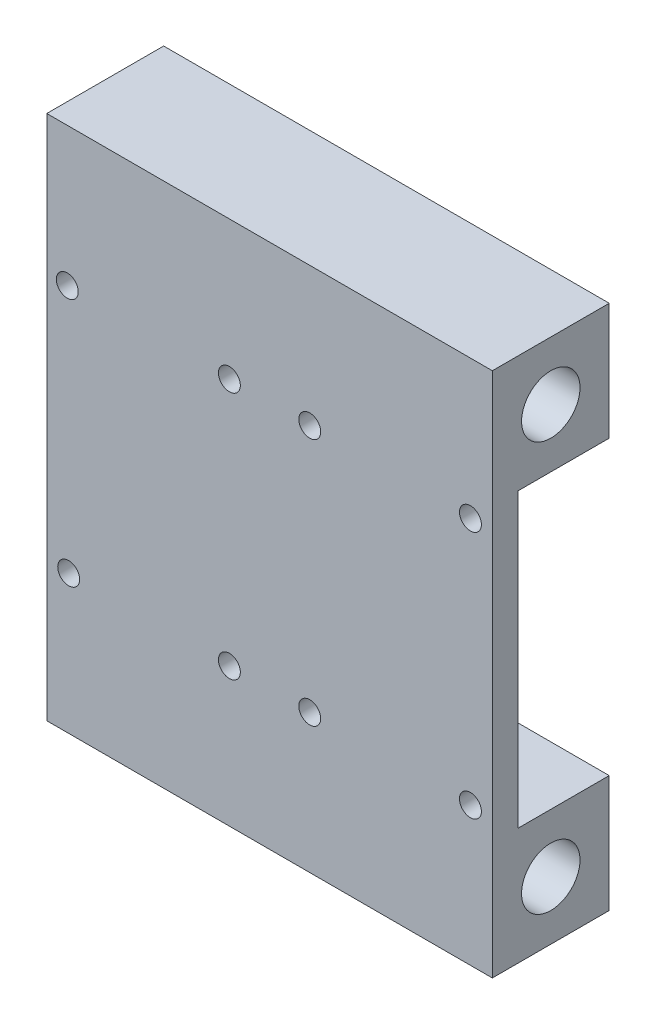
ISO-10303-21;
HEADER;
FILE_DESCRIPTION(('STEP AP214'),'2;1');
FILE_NAME('part.step','',(''),(''),'','','');
FILE_SCHEMA(('AUTOMOTIVE_DESIGN { 1 0 10303 214 1 1 1 1 }'));
ENDSEC;
DATA;
#1=APPLICATION_CONTEXT('core data for automotive mechanical design processes');
#2=APPLICATION_PROTOCOL_DEFINITION('international standard','automotive_design',2000,#1);
#3=PRODUCT_CONTEXT('',#1,'mechanical');
#4=PRODUCT('Part','Part','',(#3));
#5=PRODUCT_RELATED_PRODUCT_CATEGORY('part','',(#4));
#6=PRODUCT_DEFINITION_FORMATION('','',#4);
#7=PRODUCT_DEFINITION_CONTEXT('part definition',#1,'design');
#8=PRODUCT_DEFINITION('design','',#6,#7);
#9=PRODUCT_DEFINITION_SHAPE('','',#8);
#10=(LENGTH_UNIT() NAMED_UNIT(*) SI_UNIT(.MILLI.,.METRE.));
#11=(NAMED_UNIT(*) PLANE_ANGLE_UNIT() SI_UNIT($,.RADIAN.));
#12=(NAMED_UNIT(*) SI_UNIT($,.STERADIAN.) SOLID_ANGLE_UNIT());
#13=UNCERTAINTY_MEASURE_WITH_UNIT(LENGTH_MEASURE(1.E-05),#10,'distance_accuracy_value','');
#14=(GEOMETRIC_REPRESENTATION_CONTEXT(3) GLOBAL_UNCERTAINTY_ASSIGNED_CONTEXT((#13)) GLOBAL_UNIT_ASSIGNED_CONTEXT((#10,
#11,#12)) REPRESENTATION_CONTEXT('',''));
#15=CARTESIAN_POINT('',(0.,0.,0.));
#16=DIRECTION('',(0.,0.,1.));
#17=DIRECTION('',(1.,0.,0.));
#18=AXIS2_PLACEMENT_3D('',#15,#16,#17);
#19=CARTESIAN_POINT('',(-22.6274169979695,-8.,-4.5));
#20=DIRECTION('',(1.,0.,0.));
#21=DIRECTION('',(0.,0.,-1.));
#22=AXIS2_PLACEMENT_3D('',#19,#20,#21);
#23=CYLINDRICAL_SURFACE('',#22,4.);
#24=CARTESIAN_POINT('',(88.,-8.,-4.5));
#25=DIRECTION('',(-1.,0.,0.));
#26=DIRECTION('',(0.,0.,1.));
#27=AXIS2_PLACEMENT_3D('',#24,#25,#26);
#28=CIRCLE('',#27,4.);
#29=CARTESIAN_POINT('',(88.,-8.,-0.500000000000001));
#30=VERTEX_POINT('',#29);
#31=EDGE_CURVE('E39',#30,#30,#28,.F.);
#32=ORIENTED_EDGE('',*,*,#31,.T.);
#33=EDGE_LOOP('',(#32));
#34=FACE_BOUND('',#33,.T.);
#35=CARTESIAN_POINT('',(27.,-8.,-4.5));
#36=DIRECTION('',(1.,0.,0.));
#37=DIRECTION('',(0.,0.,-1.));
#38=AXIS2_PLACEMENT_3D('',#35,#36,#37);
#39=CIRCLE('',#38,4.);
#40=CARTESIAN_POINT('',(27.,-8.,-8.5));
#41=VERTEX_POINT('',#40);
#42=EDGE_CURVE('E141',#41,#41,#39,.F.);
#43=ORIENTED_EDGE('',*,*,#42,.T.);
#44=EDGE_LOOP('',(#43));
#45=FACE_BOUND('',#44,.T.);
#46=ADVANCED_FACE('F35',(#34,#45),#23,.F.);
#47=CARTESIAN_POINT('',(27.,37.0557833558908,80.3960337078578));
#48=DIRECTION('',(1.,0.,0.));
#49=DIRECTION('',(0.,0.,-1.));
#50=AXIS2_PLACEMENT_3D('',#47,#48,#49);
#51=PLANE('',#50);
#52=ORIENTED_EDGE('',*,*,#42,.F.);
#53=EDGE_LOOP('',(#52));
#54=FACE_BOUND('',#53,.T.);
#55=DIRECTION('',(0.,0.,1.));
#56=VECTOR('',#55,1.);
#57=CARTESIAN_POINT('',(27.,40.,3.5));
#58=LINE('',#57,#56);
#59=CARTESIAN_POINT('',(27.,40.,-12.5));
#60=VERTEX_POINT('',#59);
#61=CARTESIAN_POINT('',(27.,40.,0.));
#62=VERTEX_POINT('',#61);
#63=EDGE_CURVE('E160',#60,#62,#58,.T.);
#64=ORIENTED_EDGE('',*,*,#63,.T.);
#65=DIRECTION('',(0.,-1.,0.));
#66=VECTOR('',#65,1.);
#67=CARTESIAN_POINT('',(27.,0.,0.));
#68=LINE('',#67,#66);
#69=CARTESIAN_POINT('',(27.,0.,0.));
#70=VERTEX_POINT('',#69);
#71=EDGE_CURVE('E60',#62,#70,#68,.T.);
#72=ORIENTED_EDGE('',*,*,#71,.T.);
#73=DIRECTION('',(0.,0.,-1.));
#74=VECTOR('',#73,1.);
#75=CARTESIAN_POINT('',(27.,0.,3.5));
#76=LINE('',#75,#74);
#77=CARTESIAN_POINT('',(27.,0.,-12.5));
#78=VERTEX_POINT('',#77);
#79=EDGE_CURVE('E143',#70,#78,#76,.T.);
#80=ORIENTED_EDGE('',*,*,#79,.T.);
#81=DIRECTION('',(0.,-1.,0.));
#82=VECTOR('',#81,1.);
#83=CARTESIAN_POINT('',(27.,37.0557833558908,-12.5));
#84=LINE('',#83,#82);
#85=CARTESIAN_POINT('',(27.,-16.,-12.5));
#86=VERTEX_POINT('',#85);
#87=EDGE_CURVE('E156',#78,#86,#84,.T.);
#88=ORIENTED_EDGE('',*,*,#87,.T.);
#89=DIRECTION('',(0.,0.,-1.));
#90=VECTOR('',#89,1.);
#91=CARTESIAN_POINT('',(27.,-16.,80.3960337078578));
#92=LINE('',#91,#90);
#93=CARTESIAN_POINT('',(27.,-16.,3.5));
#94=VERTEX_POINT('',#93);
#95=EDGE_CURVE('E123',#94,#86,#92,.T.);
#96=ORIENTED_EDGE('',*,*,#95,.F.);
#97=DIRECTION('',(0.,1.,0.));
#98=VECTOR('',#97,1.);
#99=CARTESIAN_POINT('',(27.,37.0557833558908,3.5));
#100=LINE('',#99,#98);
#101=CARTESIAN_POINT('',(27.,56.,3.5));
#102=VERTEX_POINT('',#101);
#103=EDGE_CURVE('E151',#94,#102,#100,.T.);
#104=ORIENTED_EDGE('',*,*,#103,.T.);
#105=DIRECTION('',(0.,0.,-1.));
#106=VECTOR('',#105,1.);
#107=CARTESIAN_POINT('',(27.,56.,80.3960337078578));
#108=LINE('',#107,#106);
#109=CARTESIAN_POINT('',(27.,56.,-12.5));
#110=VERTEX_POINT('',#109);
#111=EDGE_CURVE('E153',#102,#110,#108,.T.);
#112=ORIENTED_EDGE('',*,*,#111,.T.);
#113=EDGE_CURVE('E154',#110,#60,#84,.T.);
#114=ORIENTED_EDGE('',*,*,#113,.T.);
#115=EDGE_LOOP('',(#64,#72,#80,#88,#96,#104,#112,#114));
#116=FACE_BOUND('',#115,.T.);
#117=CARTESIAN_POINT('',(27.,48.,-4.5));
#118=DIRECTION('',(1.,0.,0.));
#119=DIRECTION('',(0.,0.,-1.));
#120=AXIS2_PLACEMENT_3D('',#117,#118,#119);
#121=CIRCLE('',#120,4.);
#122=CARTESIAN_POINT('',(27.,48.,-8.5));
#123=VERTEX_POINT('',#122);
#124=EDGE_CURVE('E162',#123,#123,#121,.F.);
#125=ORIENTED_EDGE('',*,*,#124,.F.);
#126=EDGE_LOOP('',(#125));
#127=FACE_BOUND('',#126,.T.);
#128=ADVANCED_FACE('F240',(#54,#116,#127),#51,.F.);
#129=CARTESIAN_POINT('',(88.,56.,80.3960337078578));
#130=DIRECTION('',(-1.,0.,0.));
#131=DIRECTION('',(0.,0.,1.));
#132=AXIS2_PLACEMENT_3D('',#129,#130,#131);
#133=PLANE('',#132);
#134=ORIENTED_EDGE('',*,*,#31,.F.);
#135=EDGE_LOOP('',(#134));
#136=FACE_BOUND('',#135,.T.);
#137=DIRECTION('',(0.,0.,-1.));
#138=VECTOR('',#137,1.);
#139=CARTESIAN_POINT('',(88.,40.,3.5));
#140=LINE('',#139,#138);
#141=CARTESIAN_POINT('',(88.,40.,0.));
#142=VERTEX_POINT('',#141);
#143=CARTESIAN_POINT('',(88.,40.,-12.5));
#144=VERTEX_POINT('',#143);
#145=EDGE_CURVE('E169',#142,#144,#140,.T.);
#146=ORIENTED_EDGE('',*,*,#145,.T.);
#147=DIRECTION('',(0.,1.,0.));
#148=VECTOR('',#147,1.);
#149=CARTESIAN_POINT('',(88.,56.,-12.5));
#150=LINE('',#149,#148);
#151=CARTESIAN_POINT('',(88.,56.,-12.5));
#152=VERTEX_POINT('',#151);
#153=EDGE_CURVE('E119',#144,#152,#150,.T.);
#154=ORIENTED_EDGE('',*,*,#153,.T.);
#155=DIRECTION('',(0.,0.,-1.));
#156=VECTOR('',#155,1.);
#157=CARTESIAN_POINT('',(88.,56.,80.3960337078578));
#158=LINE('',#157,#156);
#159=CARTESIAN_POINT('',(88.,56.,3.5));
#160=VERTEX_POINT('',#159);
#161=EDGE_CURVE('E109',#160,#152,#158,.T.);
#162=ORIENTED_EDGE('',*,*,#161,.F.);
#163=DIRECTION('',(0.,-1.,0.));
#164=VECTOR('',#163,1.);
#165=CARTESIAN_POINT('',(88.,56.,3.5));
#166=LINE('',#165,#164);
#167=CARTESIAN_POINT('',(88.,-16.,3.5));
#168=VERTEX_POINT('',#167);
#169=EDGE_CURVE('E104',#160,#168,#166,.T.);
#170=ORIENTED_EDGE('',*,*,#169,.T.);
#171=DIRECTION('',(0.,0.,-1.));
#172=VECTOR('',#171,1.);
#173=CARTESIAN_POINT('',(88.,-16.,80.3960337078578));
#174=LINE('',#173,#172);
#175=CARTESIAN_POINT('',(88.,-16.,-12.5));
#176=VERTEX_POINT('',#175);
#177=EDGE_CURVE('E100',#168,#176,#174,.T.);
#178=ORIENTED_EDGE('',*,*,#177,.T.);
#179=CARTESIAN_POINT('',(88.,0.,-12.5));
#180=VERTEX_POINT('',#179);
#181=EDGE_CURVE('E52',#176,#180,#150,.T.);
#182=ORIENTED_EDGE('',*,*,#181,.T.);
#183=DIRECTION('',(0.,0.,1.));
#184=VECTOR('',#183,1.);
#185=CARTESIAN_POINT('',(88.,0.,3.5));
#186=LINE('',#185,#184);
#187=CARTESIAN_POINT('',(88.,0.,0.));
#188=VERTEX_POINT('',#187);
#189=EDGE_CURVE('E165',#180,#188,#186,.T.);
#190=ORIENTED_EDGE('',*,*,#189,.T.);
#191=DIRECTION('',(0.,1.,0.));
#192=VECTOR('',#191,1.);
#193=CARTESIAN_POINT('',(88.,0.,0.));
#194=LINE('',#193,#192);
#195=EDGE_CURVE('E167',#188,#142,#194,.T.);
#196=ORIENTED_EDGE('',*,*,#195,.T.);
#197=EDGE_LOOP('',(#146,#154,#162,#170,#178,#182,#190,#196));
#198=FACE_BOUND('',#197,.T.);
#199=CARTESIAN_POINT('',(88.,48.,-4.5));
#200=DIRECTION('',(-1.,0.,0.));
#201=DIRECTION('',(0.,0.,1.));
#202=AXIS2_PLACEMENT_3D('',#199,#200,#201);
#203=CIRCLE('',#202,4.);
#204=CARTESIAN_POINT('',(88.,48.,-0.499999999999994));
#205=VERTEX_POINT('',#204);
#206=EDGE_CURVE('E171',#205,#205,#203,.F.);
#207=ORIENTED_EDGE('',*,*,#206,.F.);
#208=EDGE_LOOP('',(#207));
#209=FACE_BOUND('',#208,.T.);
#210=ADVANCED_FACE('F101',(#136,#198,#209),#133,.F.);
#211=CARTESIAN_POINT('',(85.,3.,7.74264068711929));
#212=DIRECTION('',(0.,0.,-1.));
#213=DIRECTION('',(-1.,0.,0.));
#214=AXIS2_PLACEMENT_3D('',#211,#212,#213);
#215=CYLINDRICAL_SURFACE('',#214,1.5);
#216=CARTESIAN_POINT('',(85.,3.,3.5));
#217=DIRECTION('',(0.,0.,-1.));
#218=DIRECTION('',(-1.,0.,0.));
#219=AXIS2_PLACEMENT_3D('',#216,#217,#218);
#220=CIRCLE('',#219,1.5);
#221=CARTESIAN_POINT('',(83.5,3.,3.5));
#222=VERTEX_POINT('',#221);
#223=EDGE_CURVE('E186',#222,#222,#220,.F.);
#224=ORIENTED_EDGE('',*,*,#223,.T.);
#225=EDGE_LOOP('',(#224));
#226=FACE_BOUND('',#225,.T.);
#227=CARTESIAN_POINT('',(85.,3.,0.));
#228=DIRECTION('',(0.,0.,-1.));
#229=DIRECTION('',(-1.,0.,0.));
#230=AXIS2_PLACEMENT_3D('',#227,#228,#229);
#231=CIRCLE('',#230,1.5);
#232=CARTESIAN_POINT('',(83.5,3.,0.));
#233=VERTEX_POINT('',#232);
#234=EDGE_CURVE('E174',#233,#233,#231,.T.);
#235=ORIENTED_EDGE('',*,*,#234,.T.);
#236=EDGE_LOOP('',(#235));
#237=FACE_BOUND('',#236,.T.);
#238=ADVANCED_FACE('F298',(#226,#237),#215,.F.);
#239=CARTESIAN_POINT('',(30.,3.,7.74264068711929));
#240=DIRECTION('',(0.,0.,-1.));
#241=DIRECTION('',(-1.,0.,0.));
#242=AXIS2_PLACEMENT_3D('',#239,#240,#241);
#243=CYLINDRICAL_SURFACE('',#242,1.5);
#244=CARTESIAN_POINT('',(30.,3.,3.5));
#245=DIRECTION('',(0.,0.,-1.));
#246=DIRECTION('',(-1.,0.,0.));
#247=AXIS2_PLACEMENT_3D('',#244,#245,#246);
#248=CIRCLE('',#247,1.5);
#249=CARTESIAN_POINT('',(28.5,3.,3.5));
#250=VERTEX_POINT('',#249);
#251=EDGE_CURVE('E179',#250,#250,#248,.F.);
#252=ORIENTED_EDGE('',*,*,#251,.T.);
#253=EDGE_LOOP('',(#252));
#254=FACE_BOUND('',#253,.T.);
#255=CARTESIAN_POINT('',(30.,3.,0.));
#256=DIRECTION('',(0.,0.,-1.));
#257=DIRECTION('',(-1.,0.,0.));
#258=AXIS2_PLACEMENT_3D('',#255,#256,#257);
#259=CIRCLE('',#258,1.5);
#260=CARTESIAN_POINT('',(28.5,3.,0.));
#261=VERTEX_POINT('',#260);
#262=EDGE_CURVE('E183',#261,#261,#259,.T.);
#263=ORIENTED_EDGE('',*,*,#262,.T.);
#264=EDGE_LOOP('',(#263));
#265=FACE_BOUND('',#264,.T.);
#266=ADVANCED_FACE('F301',(#254,#265),#243,.F.);
#267=CARTESIAN_POINT('',(29.809705398951,37.,7.74264068711929));
#268=DIRECTION('',(0.,0.,-1.));
#269=DIRECTION('',(-1.,0.,0.));
#270=AXIS2_PLACEMENT_3D('',#267,#268,#269);
#271=CYLINDRICAL_SURFACE('',#270,1.5);
#272=CARTESIAN_POINT('',(29.809705398951,37.,3.5));
#273=DIRECTION('',(0.,0.,-1.));
#274=DIRECTION('',(-1.,0.,0.));
#275=AXIS2_PLACEMENT_3D('',#272,#273,#274);
#276=CIRCLE('',#275,1.5);
#277=CARTESIAN_POINT('',(28.309705398951,37.,3.5));
#278=VERTEX_POINT('',#277);
#279=EDGE_CURVE('E178',#278,#278,#276,.F.);
#280=ORIENTED_EDGE('',*,*,#279,.T.);
#281=EDGE_LOOP('',(#280));
#282=FACE_BOUND('',#281,.T.);
#283=CARTESIAN_POINT('',(29.809705398951,37.,0.));
#284=DIRECTION('',(0.,0.,-1.));
#285=DIRECTION('',(-1.,0.,0.));
#286=AXIS2_PLACEMENT_3D('',#283,#284,#285);
#287=CIRCLE('',#286,1.5);
#288=CARTESIAN_POINT('',(28.309705398951,37.,0.));
#289=VERTEX_POINT('',#288);
#290=EDGE_CURVE('E175',#289,#289,#287,.T.);
#291=ORIENTED_EDGE('',*,*,#290,.T.);
#292=EDGE_LOOP('',(#291));
#293=FACE_BOUND('',#292,.T.);
#294=ADVANCED_FACE('F285',(#282,#293),#271,.F.);
#295=CARTESIAN_POINT('',(63.,37.,7.74264068711929));
#296=DIRECTION('',(0.,0.,-1.));
#297=DIRECTION('',(-1.,0.,0.));
#298=AXIS2_PLACEMENT_3D('',#295,#296,#297);
#299=CYLINDRICAL_SURFACE('',#298,1.5);
#300=CARTESIAN_POINT('',(63.,37.,3.5));
#301=DIRECTION('',(0.,0.,-1.));
#302=DIRECTION('',(-1.,0.,0.));
#303=AXIS2_PLACEMENT_3D('',#300,#301,#302);
#304=CIRCLE('',#303,1.5);
#305=CARTESIAN_POINT('',(61.5,37.,3.5));
#306=VERTEX_POINT('',#305);
#307=EDGE_CURVE('E128',#306,#306,#304,.F.);
#308=ORIENTED_EDGE('',*,*,#307,.T.);
#309=EDGE_LOOP('',(#308));
#310=FACE_BOUND('',#309,.T.);
#311=CARTESIAN_POINT('',(63.,37.,0.));
#312=DIRECTION('',(0.,0.,-1.));
#313=DIRECTION('',(-1.,0.,0.));
#314=AXIS2_PLACEMENT_3D('',#311,#312,#313);
#315=CIRCLE('',#314,1.5);
#316=CARTESIAN_POINT('',(61.5,37.,0.));
#317=VERTEX_POINT('',#316);
#318=EDGE_CURVE('E211',#317,#317,#315,.T.);
#319=ORIENTED_EDGE('',*,*,#318,.T.);
#320=EDGE_LOOP('',(#319));
#321=FACE_BOUND('',#320,.T.);
#322=ADVANCED_FACE('F282',(#310,#321),#299,.F.);
#323=CARTESIAN_POINT('',(52.,37.,7.74264068711929));
#324=DIRECTION('',(0.,0.,-1.));
#325=DIRECTION('',(-1.,0.,0.));
#326=AXIS2_PLACEMENT_3D('',#323,#324,#325);
#327=CYLINDRICAL_SURFACE('',#326,1.5);
#328=CARTESIAN_POINT('',(52.,37.,3.5));
#329=DIRECTION('',(0.,0.,-1.));
#330=DIRECTION('',(-1.,0.,0.));
#331=AXIS2_PLACEMENT_3D('',#328,#329,#330);
#332=CIRCLE('',#331,1.5);
#333=CARTESIAN_POINT('',(50.5,37.,3.5));
#334=VERTEX_POINT('',#333);
#335=EDGE_CURVE('E214',#334,#334,#332,.F.);
#336=ORIENTED_EDGE('',*,*,#335,.T.);
#337=EDGE_LOOP('',(#336));
#338=FACE_BOUND('',#337,.T.);
#339=CARTESIAN_POINT('',(52.,37.,0.));
#340=DIRECTION('',(0.,0.,-1.));
#341=DIRECTION('',(-1.,0.,0.));
#342=AXIS2_PLACEMENT_3D('',#339,#340,#341);
#343=CIRCLE('',#342,1.5);
#344=CARTESIAN_POINT('',(50.5,37.,0.));
#345=VERTEX_POINT('',#344);
#346=EDGE_CURVE('E200',#345,#345,#343,.T.);
#347=ORIENTED_EDGE('',*,*,#346,.T.);
#348=EDGE_LOOP('',(#347));
#349=FACE_BOUND('',#348,.T.);
#350=ADVANCED_FACE('F221',(#338,#349),#327,.F.);
#351=CARTESIAN_POINT('',(52.,3.,7.74264068711929));
#352=DIRECTION('',(0.,0.,-1.));
#353=DIRECTION('',(-1.,0.,0.));
#354=AXIS2_PLACEMENT_3D('',#351,#352,#353);
#355=CYLINDRICAL_SURFACE('',#354,1.5);
#356=CARTESIAN_POINT('',(52.,3.,3.5));
#357=DIRECTION('',(0.,0.,-1.));
#358=DIRECTION('',(-1.,0.,0.));
#359=AXIS2_PLACEMENT_3D('',#356,#357,#358);
#360=CIRCLE('',#359,1.5);
#361=CARTESIAN_POINT('',(50.5,3.,3.5));
#362=VERTEX_POINT('',#361);
#363=EDGE_CURVE('E196',#362,#362,#360,.F.);
#364=ORIENTED_EDGE('',*,*,#363,.T.);
#365=EDGE_LOOP('',(#364));
#366=FACE_BOUND('',#365,.T.);
#367=CARTESIAN_POINT('',(52.,3.,0.));
#368=DIRECTION('',(0.,0.,-1.));
#369=DIRECTION('',(-1.,0.,0.));
#370=AXIS2_PLACEMENT_3D('',#367,#368,#369);
#371=CIRCLE('',#370,1.5);
#372=CARTESIAN_POINT('',(50.5,3.,0.));
#373=VERTEX_POINT('',#372);
#374=EDGE_CURVE('E193',#373,#373,#371,.T.);
#375=ORIENTED_EDGE('',*,*,#374,.T.);
#376=EDGE_LOOP('',(#375));
#377=FACE_BOUND('',#376,.T.);
#378=ADVANCED_FACE('F281',(#366,#377),#355,.F.);
#379=CARTESIAN_POINT('',(63.,3.,7.74264068711929));
#380=DIRECTION('',(0.,0.,-1.));
#381=DIRECTION('',(-1.,0.,0.));
#382=AXIS2_PLACEMENT_3D('',#379,#380,#381);
#383=CYLINDRICAL_SURFACE('',#382,1.5);
#384=CARTESIAN_POINT('',(63.,3.,3.5));
#385=DIRECTION('',(0.,0.,-1.));
#386=DIRECTION('',(-1.,0.,0.));
#387=AXIS2_PLACEMENT_3D('',#384,#385,#386);
#388=CIRCLE('',#387,1.5);
#389=CARTESIAN_POINT('',(61.5,3.,3.5));
#390=VERTEX_POINT('',#389);
#391=EDGE_CURVE('E197',#390,#390,#388,.F.);
#392=ORIENTED_EDGE('',*,*,#391,.T.);
#393=EDGE_LOOP('',(#392));
#394=FACE_BOUND('',#393,.T.);
#395=CARTESIAN_POINT('',(63.,3.,0.));
#396=DIRECTION('',(0.,0.,-1.));
#397=DIRECTION('',(-1.,0.,0.));
#398=AXIS2_PLACEMENT_3D('',#395,#396,#397);
#399=CIRCLE('',#398,1.5);
#400=CARTESIAN_POINT('',(61.5,3.,0.));
#401=VERTEX_POINT('',#400);
#402=EDGE_CURVE('E201',#401,#401,#399,.T.);
#403=ORIENTED_EDGE('',*,*,#402,.T.);
#404=EDGE_LOOP('',(#403));
#405=FACE_BOUND('',#404,.T.);
#406=ADVANCED_FACE('F290',(#394,#405),#383,.F.);
#407=CARTESIAN_POINT('',(85.,37.,7.74264068711929));
#408=DIRECTION('',(0.,0.,-1.));
#409=DIRECTION('',(-1.,0.,0.));
#410=AXIS2_PLACEMENT_3D('',#407,#408,#409);
#411=CYLINDRICAL_SURFACE('',#410,1.5);
#412=CARTESIAN_POINT('',(85.,37.,3.5));
#413=DIRECTION('',(0.,0.,-1.));
#414=DIRECTION('',(-1.,0.,0.));
#415=AXIS2_PLACEMENT_3D('',#412,#413,#414);
#416=CIRCLE('',#415,1.5);
#417=CARTESIAN_POINT('',(83.5,37.,3.5));
#418=VERTEX_POINT('',#417);
#419=EDGE_CURVE('E204',#418,#418,#416,.F.);
#420=ORIENTED_EDGE('',*,*,#419,.T.);
#421=EDGE_LOOP('',(#420));
#422=FACE_BOUND('',#421,.T.);
#423=CARTESIAN_POINT('',(85.,37.,0.));
#424=DIRECTION('',(0.,0.,-1.));
#425=DIRECTION('',(-1.,0.,0.));
#426=AXIS2_PLACEMENT_3D('',#423,#424,#425);
#427=CIRCLE('',#426,1.5);
#428=CARTESIAN_POINT('',(83.5,37.,0.));
#429=VERTEX_POINT('',#428);
#430=EDGE_CURVE('E182',#429,#429,#427,.T.);
#431=ORIENTED_EDGE('',*,*,#430,.T.);
#432=EDGE_LOOP('',(#431));
#433=FACE_BOUND('',#432,.T.);
#434=ADVANCED_FACE('F287',(#422,#433),#411,.F.);
#435=CARTESIAN_POINT('',(-22.6274169979695,56.,3.50000000000001));
#436=DIRECTION('',(0.,1.,0.));
#437=DIRECTION('',(0.,0.,1.));
#438=AXIS2_PLACEMENT_3D('',#435,#436,#437);
#439=PLANE('',#438);
#440=ORIENTED_EDGE('',*,*,#161,.T.);
#441=DIRECTION('',(1.,0.,0.));
#442=VECTOR('',#441,1.);
#443=CARTESIAN_POINT('',(-22.6274169979695,56.,-12.5));
#444=LINE('',#443,#442);
#445=EDGE_CURVE('E135',#110,#152,#444,.T.);
#446=ORIENTED_EDGE('',*,*,#445,.F.);
#447=ORIENTED_EDGE('',*,*,#111,.F.);
#448=DIRECTION('',(1.,0.,0.));
#449=VECTOR('',#448,1.);
#450=CARTESIAN_POINT('',(-22.6274169979695,56.,3.50000000000001));
#451=LINE('',#450,#449);
#452=EDGE_CURVE('E132',#102,#160,#451,.T.);
#453=ORIENTED_EDGE('',*,*,#452,.T.);
#454=EDGE_LOOP('',(#440,#446,#447,#453));
#455=FACE_BOUND('',#454,.T.);
#456=ADVANCED_FACE('F245',(#455),#439,.T.);
#457=CARTESIAN_POINT('',(-22.6274169979695,56.,-12.5));
#458=DIRECTION('',(0.,0.,-1.));
#459=DIRECTION('',(0.,1.,0.));
#460=AXIS2_PLACEMENT_3D('',#457,#458,#459);
#461=PLANE('',#460);
#462=ORIENTED_EDGE('',*,*,#153,.F.);
#463=DIRECTION('',(1.,0.,0.));
#464=VECTOR('',#463,1.);
#465=CARTESIAN_POINT('',(-22.6274169979695,40.,-12.5));
#466=LINE('',#465,#464);
#467=EDGE_CURVE('E126',#60,#144,#466,.T.);
#468=ORIENTED_EDGE('',*,*,#467,.F.);
#469=ORIENTED_EDGE('',*,*,#113,.F.);
#470=ORIENTED_EDGE('',*,*,#445,.T.);
#471=EDGE_LOOP('',(#462,#468,#469,#470));
#472=FACE_BOUND('',#471,.T.);
#473=ADVANCED_FACE('F248',(#472),#461,.T.);
#474=CARTESIAN_POINT('',(-22.6274169979695,40.,3.5));
#475=DIRECTION('',(0.,-1.,0.));
#476=DIRECTION('',(0.,0.,-1.));
#477=AXIS2_PLACEMENT_3D('',#474,#475,#476);
#478=PLANE('',#477);
#479=ORIENTED_EDGE('',*,*,#145,.F.);
#480=DIRECTION('',(-1.,0.,0.));
#481=VECTOR('',#480,1.);
#482=CARTESIAN_POINT('',(0.,40.,0.));
#483=LINE('',#482,#481);
#484=EDGE_CURVE('E11',#142,#62,#483,.T.);
#485=ORIENTED_EDGE('',*,*,#484,.T.);
#486=ORIENTED_EDGE('',*,*,#63,.F.);
#487=ORIENTED_EDGE('',*,*,#467,.T.);
#488=EDGE_LOOP('',(#479,#485,#486,#487));
#489=FACE_BOUND('',#488,.T.);
#490=ADVANCED_FACE('F253',(#489),#478,.T.);
#491=CARTESIAN_POINT('',(-22.6274169979695,0.,3.5));
#492=DIRECTION('',(0.,1.,0.));
#493=DIRECTION('',(0.,0.,1.));
#494=AXIS2_PLACEMENT_3D('',#491,#492,#493);
#495=PLANE('',#494);
#496=ORIENTED_EDGE('',*,*,#189,.F.);
#497=DIRECTION('',(1.,0.,0.));
#498=VECTOR('',#497,1.);
#499=CARTESIAN_POINT('',(-22.6274169979695,0.,-12.5));
#500=LINE('',#499,#498);
#501=EDGE_CURVE('E118',#78,#180,#500,.T.);
#502=ORIENTED_EDGE('',*,*,#501,.F.);
#503=ORIENTED_EDGE('',*,*,#79,.F.);
#504=DIRECTION('',(1.,0.,0.));
#505=VECTOR('',#504,1.);
#506=CARTESIAN_POINT('',(110.,0.,0.));
#507=LINE('',#506,#505);
#508=EDGE_CURVE('E44',#70,#188,#507,.T.);
#509=ORIENTED_EDGE('',*,*,#508,.T.);
#510=EDGE_LOOP('',(#496,#502,#503,#509));
#511=FACE_BOUND('',#510,.T.);
#512=ADVANCED_FACE('F260',(#511),#495,.T.);
#513=CARTESIAN_POINT('',(-22.6274169979695,0.,-12.5));
#514=DIRECTION('',(0.,0.,-1.));
#515=DIRECTION('',(0.,1.,0.));
#516=AXIS2_PLACEMENT_3D('',#513,#514,#515);
#517=PLANE('',#516);
#518=ORIENTED_EDGE('',*,*,#181,.F.);
#519=DIRECTION('',(1.,0.,0.));
#520=VECTOR('',#519,1.);
#521=CARTESIAN_POINT('',(-22.6274169979695,-16.,-12.5));
#522=LINE('',#521,#520);
#523=EDGE_CURVE('E116',#86,#176,#522,.T.);
#524=ORIENTED_EDGE('',*,*,#523,.F.);
#525=ORIENTED_EDGE('',*,*,#87,.F.);
#526=ORIENTED_EDGE('',*,*,#501,.T.);
#527=EDGE_LOOP('',(#518,#524,#525,#526));
#528=FACE_BOUND('',#527,.T.);
#529=ADVANCED_FACE('F114',(#528),#517,.T.);
#530=CARTESIAN_POINT('',(-22.6274169979695,-16.,-12.5));
#531=DIRECTION('',(0.,-1.,0.));
#532=DIRECTION('',(0.,0.,-1.));
#533=AXIS2_PLACEMENT_3D('',#530,#531,#532);
#534=PLANE('',#533);
#535=ORIENTED_EDGE('',*,*,#177,.F.);
#536=DIRECTION('',(1.,0.,0.));
#537=VECTOR('',#536,1.);
#538=CARTESIAN_POINT('',(-22.6274169979695,-16.,3.5));
#539=LINE('',#538,#537);
#540=EDGE_CURVE('E124',#94,#168,#539,.T.);
#541=ORIENTED_EDGE('',*,*,#540,.F.);
#542=ORIENTED_EDGE('',*,*,#95,.T.);
#543=ORIENTED_EDGE('',*,*,#523,.T.);
#544=EDGE_LOOP('',(#535,#541,#542,#543));
#545=FACE_BOUND('',#544,.T.);
#546=ADVANCED_FACE('F122',(#545),#534,.T.);
#547=CARTESIAN_POINT('',(0.,0.,0.));
#548=DIRECTION('',(0.,0.,-1.));
#549=DIRECTION('',(-1.,0.,0.));
#550=AXIS2_PLACEMENT_3D('',#547,#548,#549);
#551=PLANE('',#550);
#552=ORIENTED_EDGE('',*,*,#195,.F.);
#553=ORIENTED_EDGE('',*,*,#508,.F.);
#554=ORIENTED_EDGE('',*,*,#71,.F.);
#555=ORIENTED_EDGE('',*,*,#484,.F.);
#556=EDGE_LOOP('',(#552,#553,#554,#555));
#557=FACE_BOUND('',#556,.T.);
#558=ORIENTED_EDGE('',*,*,#430,.F.);
#559=EDGE_LOOP('',(#558));
#560=FACE_BOUND('',#559,.T.);
#561=ORIENTED_EDGE('',*,*,#402,.F.);
#562=EDGE_LOOP('',(#561));
#563=FACE_BOUND('',#562,.T.);
#564=ORIENTED_EDGE('',*,*,#374,.F.);
#565=EDGE_LOOP('',(#564));
#566=FACE_BOUND('',#565,.T.);
#567=ORIENTED_EDGE('',*,*,#346,.F.);
#568=EDGE_LOOP('',(#567));
#569=FACE_BOUND('',#568,.T.);
#570=ORIENTED_EDGE('',*,*,#318,.F.);
#571=EDGE_LOOP('',(#570));
#572=FACE_BOUND('',#571,.T.);
#573=ORIENTED_EDGE('',*,*,#290,.F.);
#574=EDGE_LOOP('',(#573));
#575=FACE_BOUND('',#574,.T.);
#576=ORIENTED_EDGE('',*,*,#262,.F.);
#577=EDGE_LOOP('',(#576));
#578=FACE_BOUND('',#577,.T.);
#579=ORIENTED_EDGE('',*,*,#234,.F.);
#580=EDGE_LOOP('',(#579));
#581=FACE_BOUND('',#580,.T.);
#582=ADVANCED_FACE('F37',(#557,#560,#563,#566,#569,#572,#575,#578,#581),#551,.T.);
#583=CARTESIAN_POINT('',(0.,0.,3.5));
#584=DIRECTION('',(0.,0.,-1.));
#585=DIRECTION('',(-1.,0.,0.));
#586=AXIS2_PLACEMENT_3D('',#583,#584,#585);
#587=PLANE('',#586);
#588=ORIENTED_EDGE('',*,*,#419,.F.);
#589=EDGE_LOOP('',(#588));
#590=FACE_BOUND('',#589,.T.);
#591=ORIENTED_EDGE('',*,*,#391,.F.);
#592=EDGE_LOOP('',(#591));
#593=FACE_BOUND('',#592,.T.);
#594=ORIENTED_EDGE('',*,*,#363,.F.);
#595=EDGE_LOOP('',(#594));
#596=FACE_BOUND('',#595,.T.);
#597=ORIENTED_EDGE('',*,*,#335,.F.);
#598=EDGE_LOOP('',(#597));
#599=FACE_BOUND('',#598,.T.);
#600=ORIENTED_EDGE('',*,*,#307,.F.);
#601=EDGE_LOOP('',(#600));
#602=FACE_BOUND('',#601,.T.);
#603=ORIENTED_EDGE('',*,*,#279,.F.);
#604=EDGE_LOOP('',(#603));
#605=FACE_BOUND('',#604,.T.);
#606=ORIENTED_EDGE('',*,*,#251,.F.);
#607=EDGE_LOOP('',(#606));
#608=FACE_BOUND('',#607,.T.);
#609=ORIENTED_EDGE('',*,*,#223,.F.);
#610=EDGE_LOOP('',(#609));
#611=FACE_BOUND('',#610,.T.);
#612=ORIENTED_EDGE('',*,*,#540,.T.);
#613=ORIENTED_EDGE('',*,*,#169,.F.);
#614=ORIENTED_EDGE('',*,*,#452,.F.);
#615=ORIENTED_EDGE('',*,*,#103,.F.);
#616=EDGE_LOOP('',(#612,#613,#614,#615));
#617=FACE_BOUND('',#616,.T.);
#618=ADVANCED_FACE('F224',(#590,#593,#596,#599,#602,#605,#608,#611,#617),#587,.F.);
#619=CARTESIAN_POINT('',(-22.6274169979695,48.,-4.5));
#620=DIRECTION('',(1.,0.,0.));
#621=DIRECTION('',(0.,0.,-1.));
#622=AXIS2_PLACEMENT_3D('',#619,#620,#621);
#623=CYLINDRICAL_SURFACE('',#622,4.);
#624=ORIENTED_EDGE('',*,*,#206,.T.);
#625=EDGE_LOOP('',(#624));
#626=FACE_BOUND('',#625,.T.);
#627=ORIENTED_EDGE('',*,*,#124,.T.);
#628=EDGE_LOOP('',(#627));
#629=FACE_BOUND('',#628,.T.);
#630=ADVANCED_FACE('F227',(#626,#629),#623,.F.);
#631=CLOSED_SHELL('',(#46,#128,#210,#238,#266,#294,#322,#350,#378,#406,#434,#456,#473,#490,#512,
#529,#546,#582,#618,#630));
#632=MANIFOLD_SOLID_BREP('B2',#631);
#633=ADVANCED_BREP_SHAPE_REPRESENTATION('',(#18,#632),#14);
#634=SHAPE_DEFINITION_REPRESENTATION(#9,#633);
ENDSEC;
END-ISO-10303-21;
